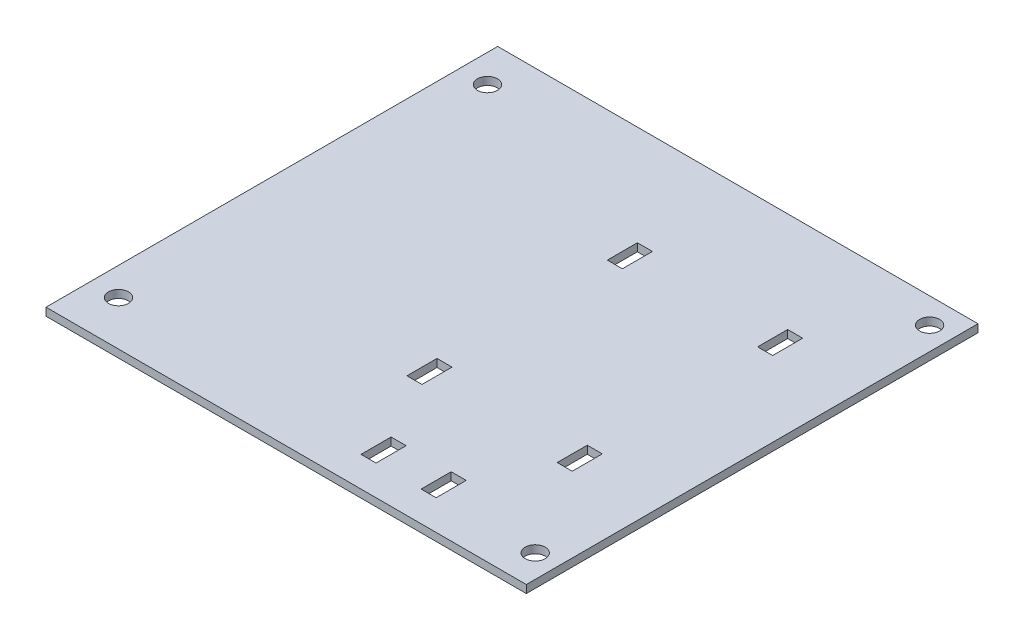
ISO-10303-21;
HEADER;
FILE_DESCRIPTION(('STEP AP214'),'2;1');
FILE_NAME('part.step','',(''),(''),'','','');
FILE_SCHEMA(('AUTOMOTIVE_DESIGN { 1 0 10303 214 1 1 1 1 }'));
ENDSEC;
DATA;
#1=APPLICATION_CONTEXT('core data for automotive mechanical design processes');
#2=APPLICATION_PROTOCOL_DEFINITION('international standard','automotive_design',2000,#1);
#3=PRODUCT_CONTEXT('',#1,'mechanical');
#4=PRODUCT('Part','Part','',(#3));
#5=PRODUCT_RELATED_PRODUCT_CATEGORY('part','',(#4));
#6=PRODUCT_DEFINITION_FORMATION('','',#4);
#7=PRODUCT_DEFINITION_CONTEXT('part definition',#1,'design');
#8=PRODUCT_DEFINITION('design','',#6,#7);
#9=PRODUCT_DEFINITION_SHAPE('','',#8);
#10=(LENGTH_UNIT() NAMED_UNIT(*) SI_UNIT(.MILLI.,.METRE.));
#11=(NAMED_UNIT(*) PLANE_ANGLE_UNIT() SI_UNIT($,.RADIAN.));
#12=(NAMED_UNIT(*) SI_UNIT($,.STERADIAN.) SOLID_ANGLE_UNIT());
#13=UNCERTAINTY_MEASURE_WITH_UNIT(LENGTH_MEASURE(1.E-05),#10,'distance_accuracy_value','');
#14=(GEOMETRIC_REPRESENTATION_CONTEXT(3) GLOBAL_UNCERTAINTY_ASSIGNED_CONTEXT((#13)) GLOBAL_UNIT_ASSIGNED_CONTEXT((#10,
#11,#12)) REPRESENTATION_CONTEXT('',''));
#15=CARTESIAN_POINT('',(0.,0.,0.));
#16=DIRECTION('',(0.,0.,1.));
#17=DIRECTION('',(1.,0.,0.));
#18=AXIS2_PLACEMENT_3D('',#15,#16,#17);
#19=CARTESIAN_POINT('',(-32.2440500490529,1.57,-18.5489965335949));
#20=DIRECTION('',(0.,0.,-1.));
#21=DIRECTION('',(-1.,0.,0.));
#22=AXIS2_PLACEMENT_3D('',#19,#20,#21);
#23=PLANE('',#22);
#24=DIRECTION('',(1.,0.,0.));
#25=VECTOR('',#24,1.);
#26=CARTESIAN_POINT('',(-32.2440500490529,0.,-18.5489965335949));
#27=LINE('',#26,#25);
#28=CARTESIAN_POINT('',(-31.7440500490529,0.,-18.5489965335949));
#29=VERTEX_POINT('',#28);
#30=CARTESIAN_POINT('',(64.1459499509471,0.,-18.5489965335949));
#31=VERTEX_POINT('',#30);
#32=EDGE_CURVE('E389',#29,#31,#27,.T.);
#33=ORIENTED_EDGE('',*,*,#32,.T.);
#34=DIRECTION('',(0.,1.,0.));
#35=VECTOR('',#34,1.);
#36=CARTESIAN_POINT('',(64.1459499509471,0.,-18.5489965335949));
#37=LINE('',#36,#35);
#38=CARTESIAN_POINT('',(64.1459499509471,1.57,-18.5489965335949));
#39=VERTEX_POINT('',#38);
#40=EDGE_CURVE('E352',#31,#39,#37,.T.);
#41=ORIENTED_EDGE('',*,*,#40,.T.);
#42=DIRECTION('',(1.,0.,0.));
#43=VECTOR('',#42,1.);
#44=CARTESIAN_POINT('',(-32.2440500490529,1.57,-18.5489965335949));
#45=LINE('',#44,#43);
#46=CARTESIAN_POINT('',(-31.7440500490529,1.57,-18.5489965335949));
#47=VERTEX_POINT('',#46);
#48=EDGE_CURVE('E392',#47,#39,#45,.T.);
#49=ORIENTED_EDGE('',*,*,#48,.F.);
#50=DIRECTION('',(0.,1.,0.));
#51=VECTOR('',#50,1.);
#52=CARTESIAN_POINT('',(-31.7440500490529,0.,-18.5489965335949));
#53=LINE('',#52,#51);
#54=EDGE_CURVE('E360',#29,#47,#53,.T.);
#55=ORIENTED_EDGE('',*,*,#54,.F.);
#56=EDGE_LOOP('',(#33,#41,#49,#55));
#57=FACE_BOUND('',#56,.T.);
#58=ADVANCED_FACE('F34',(#57),#23,.F.);
#59=CARTESIAN_POINT('',(-32.2440500490529,1.57,-108.718996533595));
#60=DIRECTION('',(0.,0.,1.));
#61=DIRECTION('',(1.,0.,0.));
#62=AXIS2_PLACEMENT_3D('',#59,#60,#61);
#63=PLANE('',#62);
#64=DIRECTION('',(-1.,0.,0.));
#65=VECTOR('',#64,1.);
#66=CARTESIAN_POINT('',(-32.2440500490529,1.57,-108.718996533595));
#67=LINE('',#66,#65);
#68=CARTESIAN_POINT('',(64.1459499509471,1.57,-108.718996533595));
#69=VERTEX_POINT('',#68);
#70=CARTESIAN_POINT('',(-31.7440500490529,1.57,-108.718996533595));
#71=VERTEX_POINT('',#70);
#72=EDGE_CURVE('E395',#69,#71,#67,.T.);
#73=ORIENTED_EDGE('',*,*,#72,.F.);
#74=DIRECTION('',(0.,1.,0.));
#75=VECTOR('',#74,1.);
#76=CARTESIAN_POINT('',(64.1459499509471,0.,-108.718996533595));
#77=LINE('',#76,#75);
#78=CARTESIAN_POINT('',(64.1459499509471,0.,-108.718996533595));
#79=VERTEX_POINT('',#78);
#80=EDGE_CURVE('E350',#79,#69,#77,.T.);
#81=ORIENTED_EDGE('',*,*,#80,.F.);
#82=DIRECTION('',(-1.,0.,0.));
#83=VECTOR('',#82,1.);
#84=CARTESIAN_POINT('',(-32.2440500490529,0.,-108.718996533595));
#85=LINE('',#84,#83);
#86=CARTESIAN_POINT('',(-31.7440500490529,0.,-108.718996533595));
#87=VERTEX_POINT('',#86);
#88=EDGE_CURVE('E396',#79,#87,#85,.T.);
#89=ORIENTED_EDGE('',*,*,#88,.T.);
#90=DIRECTION('',(0.,1.,0.));
#91=VECTOR('',#90,1.);
#92=CARTESIAN_POINT('',(-31.7440500490529,0.,-108.718996533595));
#93=LINE('',#92,#91);
#94=EDGE_CURVE('E363',#87,#71,#93,.T.);
#95=ORIENTED_EDGE('',*,*,#94,.T.);
#96=EDGE_LOOP('',(#73,#81,#89,#95));
#97=FACE_BOUND('',#96,.T.);
#98=ADVANCED_FACE('F485',(#97),#63,.F.);
#99=CARTESIAN_POINT('',(0.,1.57,0.));
#100=DIRECTION('',(0.,1.,0.));
#101=DIRECTION('',(0.,0.,1.));
#102=AXIS2_PLACEMENT_3D('',#99,#100,#101);
#103=PLANE('',#102);
#104=DIRECTION('',(0.,0.,1.));
#105=VECTOR('',#104,1.);
#106=CARTESIAN_POINT('',(37.1459499509471,1.57,-30.5489965335949));
#107=LINE('',#106,#105);
#108=CARTESIAN_POINT('',(37.1459499509471,1.57,-30.5489965335949));
#109=VERTEX_POINT('',#108);
#110=CARTESIAN_POINT('',(37.1459499509471,1.57,-24.5489965335949));
#111=VERTEX_POINT('',#110);
#112=EDGE_CURVE('E48',#109,#111,#107,.T.);
#113=ORIENTED_EDGE('',*,*,#112,.F.);
#114=DIRECTION('',(-1.,0.,0.));
#115=VECTOR('',#114,1.);
#116=CARTESIAN_POINT('',(37.1459499509471,1.57,-30.5489965335949));
#117=LINE('',#116,#115);
#118=CARTESIAN_POINT('',(40.1459499509471,1.57,-30.5489965335949));
#119=VERTEX_POINT('',#118);
#120=EDGE_CURVE('E237',#119,#109,#117,.T.);
#121=ORIENTED_EDGE('',*,*,#120,.F.);
#122=DIRECTION('',(0.,0.,-1.));
#123=VECTOR('',#122,1.);
#124=CARTESIAN_POINT('',(40.1459499509471,1.57,-30.5489965335949));
#125=LINE('',#124,#123);
#126=CARTESIAN_POINT('',(40.1459499509471,1.57,-24.5489965335949));
#127=VERTEX_POINT('',#126);
#128=EDGE_CURVE('E221',#127,#119,#125,.T.);
#129=ORIENTED_EDGE('',*,*,#128,.F.);
#130=DIRECTION('',(1.,0.,0.));
#131=VECTOR('',#130,1.);
#132=CARTESIAN_POINT('',(37.1459499509471,1.57,-24.5489965335949));
#133=LINE('',#132,#131);
#134=EDGE_CURVE('E230',#111,#127,#133,.T.);
#135=ORIENTED_EDGE('',*,*,#134,.F.);
#136=EDGE_LOOP('',(#113,#121,#129,#135));
#137=FACE_BOUND('',#136,.T.);
#138=DIRECTION('',(0.,0.,1.));
#139=VECTOR('',#138,1.);
#140=CARTESIAN_POINT('',(25.1459499509471,1.57,-30.5489965335949));
#141=LINE('',#140,#139);
#142=CARTESIAN_POINT('',(25.1459499509471,1.57,-30.5489965335949));
#143=VERTEX_POINT('',#142);
#144=CARTESIAN_POINT('',(25.1459499509471,1.57,-24.5489965335949));
#145=VERTEX_POINT('',#144);
#146=EDGE_CURVE('E244',#143,#145,#141,.T.);
#147=ORIENTED_EDGE('',*,*,#146,.F.);
#148=DIRECTION('',(-1.,0.,0.));
#149=VECTOR('',#148,1.);
#150=CARTESIAN_POINT('',(25.1459499509471,1.57,-30.5489965335949));
#151=LINE('',#150,#149);
#152=CARTESIAN_POINT('',(28.1459499509471,1.57,-30.5489965335949));
#153=VERTEX_POINT('',#152);
#154=EDGE_CURVE('E254',#153,#143,#151,.T.);
#155=ORIENTED_EDGE('',*,*,#154,.F.);
#156=DIRECTION('',(0.,0.,-1.));
#157=VECTOR('',#156,1.);
#158=CARTESIAN_POINT('',(28.1459499509471,1.57,-30.5489965335949));
#159=LINE('',#158,#157);
#160=CARTESIAN_POINT('',(28.1459499509471,1.57,-24.5489965335949));
#161=VERTEX_POINT('',#160);
#162=EDGE_CURVE('E251',#161,#153,#159,.T.);
#163=ORIENTED_EDGE('',*,*,#162,.F.);
#164=DIRECTION('',(1.,0.,0.));
#165=VECTOR('',#164,1.);
#166=CARTESIAN_POINT('',(25.1459499509471,1.57,-24.5489965335949));
#167=LINE('',#166,#165);
#168=EDGE_CURVE('E248',#145,#161,#167,.T.);
#169=ORIENTED_EDGE('',*,*,#168,.F.);
#170=EDGE_LOOP('',(#147,#155,#163,#169));
#171=FACE_BOUND('',#170,.T.);
#172=DIRECTION('',(0.,0.,1.));
#173=VECTOR('',#172,1.);
#174=CARTESIAN_POINT('',(46.1459499509471,1.57,-48.7189965335949));
#175=LINE('',#174,#173);
#176=CARTESIAN_POINT('',(46.1459499509471,1.57,-48.7189965335949));
#177=VERTEX_POINT('',#176);
#178=CARTESIAN_POINT('',(46.1459499509471,1.57,-42.7189965335949));
#179=VERTEX_POINT('',#178);
#180=EDGE_CURVE('E260',#177,#179,#175,.T.);
#181=ORIENTED_EDGE('',*,*,#180,.F.);
#182=DIRECTION('',(-1.,0.,0.));
#183=VECTOR('',#182,1.);
#184=CARTESIAN_POINT('',(46.1459499509471,1.57,-48.7189965335949));
#185=LINE('',#184,#183);
#186=CARTESIAN_POINT('',(49.1459499509471,1.57,-48.7189965335949));
#187=VERTEX_POINT('',#186);
#188=EDGE_CURVE('E274',#187,#177,#185,.T.);
#189=ORIENTED_EDGE('',*,*,#188,.F.);
#190=DIRECTION('',(0.,0.,-1.));
#191=VECTOR('',#190,1.);
#192=CARTESIAN_POINT('',(49.1459499509471,1.57,-48.7189965335949));
#193=LINE('',#192,#191);
#194=CARTESIAN_POINT('',(49.1459499509471,1.57,-42.7189965335949));
#195=VERTEX_POINT('',#194);
#196=EDGE_CURVE('E271',#195,#187,#193,.T.);
#197=ORIENTED_EDGE('',*,*,#196,.F.);
#198=DIRECTION('',(1.,0.,0.));
#199=VECTOR('',#198,1.);
#200=CARTESIAN_POINT('',(46.1459499509471,1.57,-42.7189965335949));
#201=LINE('',#200,#199);
#202=EDGE_CURVE('E268',#179,#195,#201,.T.);
#203=ORIENTED_EDGE('',*,*,#202,.F.);
#204=EDGE_LOOP('',(#181,#189,#197,#203));
#205=FACE_BOUND('',#204,.T.);
#206=DIRECTION('',(0.,0.,1.));
#207=VECTOR('',#206,1.);
#208=CARTESIAN_POINT('',(16.1459499509471,1.57,-48.7189965335949));
#209=LINE('',#208,#207);
#210=CARTESIAN_POINT('',(16.1459499509471,1.57,-48.7189965335949));
#211=VERTEX_POINT('',#210);
#212=CARTESIAN_POINT('',(16.1459499509471,1.57,-42.7189965335949));
#213=VERTEX_POINT('',#212);
#214=EDGE_CURVE('E280',#211,#213,#209,.T.);
#215=ORIENTED_EDGE('',*,*,#214,.F.);
#216=DIRECTION('',(-1.,0.,0.));
#217=VECTOR('',#216,1.);
#218=CARTESIAN_POINT('',(16.1459499509471,1.57,-48.7189965335949));
#219=LINE('',#218,#217);
#220=CARTESIAN_POINT('',(19.1459499509471,1.57,-48.7189965335949));
#221=VERTEX_POINT('',#220);
#222=EDGE_CURVE('E294',#221,#211,#219,.T.);
#223=ORIENTED_EDGE('',*,*,#222,.F.);
#224=DIRECTION('',(0.,0.,-1.));
#225=VECTOR('',#224,1.);
#226=CARTESIAN_POINT('',(19.1459499509471,1.57,-48.7189965335949));
#227=LINE('',#226,#225);
#228=CARTESIAN_POINT('',(19.1459499509471,1.57,-42.7189965335949));
#229=VERTEX_POINT('',#228);
#230=EDGE_CURVE('E291',#229,#221,#227,.T.);
#231=ORIENTED_EDGE('',*,*,#230,.F.);
#232=DIRECTION('',(1.,0.,0.));
#233=VECTOR('',#232,1.);
#234=CARTESIAN_POINT('',(16.1459499509471,1.57,-42.7189965335949));
#235=LINE('',#234,#233);
#236=EDGE_CURVE('E288',#213,#229,#235,.T.);
#237=ORIENTED_EDGE('',*,*,#236,.F.);
#238=EDGE_LOOP('',(#215,#223,#231,#237));
#239=FACE_BOUND('',#238,.T.);
#240=DIRECTION('',(0.,0.,1.));
#241=VECTOR('',#240,1.);
#242=CARTESIAN_POINT('',(46.1459499509471,1.57,-88.7189965335949));
#243=LINE('',#242,#241);
#244=CARTESIAN_POINT('',(46.1459499509471,1.57,-88.7189965335949));
#245=VERTEX_POINT('',#244);
#246=CARTESIAN_POINT('',(46.1459499509471,1.57,-82.7189965335949));
#247=VERTEX_POINT('',#246);
#248=EDGE_CURVE('E300',#245,#247,#243,.T.);
#249=ORIENTED_EDGE('',*,*,#248,.F.);
#250=DIRECTION('',(-1.,0.,0.));
#251=VECTOR('',#250,1.);
#252=CARTESIAN_POINT('',(46.1459499509471,1.57,-88.7189965335949));
#253=LINE('',#252,#251);
#254=CARTESIAN_POINT('',(49.1459499509471,1.57,-88.7189965335949));
#255=VERTEX_POINT('',#254);
#256=EDGE_CURVE('E314',#255,#245,#253,.T.);
#257=ORIENTED_EDGE('',*,*,#256,.F.);
#258=DIRECTION('',(0.,0.,-1.));
#259=VECTOR('',#258,1.);
#260=CARTESIAN_POINT('',(49.1459499509471,1.57,-88.7189965335949));
#261=LINE('',#260,#259);
#262=CARTESIAN_POINT('',(49.1459499509471,1.57,-82.7189965335949));
#263=VERTEX_POINT('',#262);
#264=EDGE_CURVE('E311',#263,#255,#261,.T.);
#265=ORIENTED_EDGE('',*,*,#264,.F.);
#266=DIRECTION('',(1.,0.,0.));
#267=VECTOR('',#266,1.);
#268=CARTESIAN_POINT('',(46.1459499509471,1.57,-82.7189965335949));
#269=LINE('',#268,#267);
#270=EDGE_CURVE('E308',#247,#263,#269,.T.);
#271=ORIENTED_EDGE('',*,*,#270,.F.);
#272=EDGE_LOOP('',(#249,#257,#265,#271));
#273=FACE_BOUND('',#272,.T.);
#274=DIRECTION('',(0.,0.,1.));
#275=VECTOR('',#274,1.);
#276=CARTESIAN_POINT('',(16.1459499509471,1.57,-88.7189965335949));
#277=LINE('',#276,#275);
#278=CARTESIAN_POINT('',(16.1459499509471,1.57,-88.7189965335949));
#279=VERTEX_POINT('',#278);
#280=CARTESIAN_POINT('',(16.1459499509471,1.57,-82.7189965335949));
#281=VERTEX_POINT('',#280);
#282=EDGE_CURVE('E320',#279,#281,#277,.T.);
#283=ORIENTED_EDGE('',*,*,#282,.F.);
#284=DIRECTION('',(-1.,0.,0.));
#285=VECTOR('',#284,1.);
#286=CARTESIAN_POINT('',(16.1459499509471,1.57,-88.7189965335949));
#287=LINE('',#286,#285);
#288=CARTESIAN_POINT('',(19.1459499509471,1.57,-88.7189965335949));
#289=VERTEX_POINT('',#288);
#290=EDGE_CURVE('E334',#289,#279,#287,.T.);
#291=ORIENTED_EDGE('',*,*,#290,.F.);
#292=DIRECTION('',(0.,0.,-1.));
#293=VECTOR('',#292,1.);
#294=CARTESIAN_POINT('',(19.1459499509471,1.57,-88.7189965335949));
#295=LINE('',#294,#293);
#296=CARTESIAN_POINT('',(19.1459499509471,1.57,-82.7189965335949));
#297=VERTEX_POINT('',#296);
#298=EDGE_CURVE('E331',#297,#289,#295,.T.);
#299=ORIENTED_EDGE('',*,*,#298,.F.);
#300=DIRECTION('',(1.,0.,0.));
#301=VECTOR('',#300,1.);
#302=CARTESIAN_POINT('',(16.1459499509471,1.57,-82.7189965335949));
#303=LINE('',#302,#301);
#304=EDGE_CURVE('E328',#281,#297,#303,.T.);
#305=ORIENTED_EDGE('',*,*,#304,.F.);
#306=EDGE_LOOP('',(#283,#291,#299,#305));
#307=FACE_BOUND('',#306,.T.);
#308=DIRECTION('',(0.,0.,1.));
#309=VECTOR('',#308,1.);
#310=CARTESIAN_POINT('',(64.1459499509471,1.57,-108.718996533595));
#311=LINE('',#310,#309);
#312=EDGE_CURVE('E340',#69,#39,#311,.T.);
#313=ORIENTED_EDGE('',*,*,#312,.F.);
#314=ORIENTED_EDGE('',*,*,#72,.T.);
#315=DIRECTION('',(0.,0.,-1.));
#316=VECTOR('',#315,1.);
#317=CARTESIAN_POINT('',(-31.7440500490529,1.57,-18.5489965335949));
#318=LINE('',#317,#316);
#319=EDGE_CURVE('E355',#47,#71,#318,.T.);
#320=ORIENTED_EDGE('',*,*,#319,.F.);
#321=ORIENTED_EDGE('',*,*,#48,.T.);
#322=EDGE_LOOP('',(#313,#314,#320,#321));
#323=FACE_BOUND('',#322,.T.);
#324=CARTESIAN_POINT('',(59.5659499509471,1.57,-103.638996533595));
#325=DIRECTION('',(0.,1.,0.));
#326=DIRECTION('',(0.,0.,1.));
#327=AXIS2_PLACEMENT_3D('',#324,#325,#326);
#328=CIRCLE('',#327,2.);
#329=CARTESIAN_POINT('',(59.5659499509471,1.57,-101.638996533595));
#330=VERTEX_POINT('',#329);
#331=EDGE_CURVE('E366',#330,#330,#328,.T.);
#332=ORIENTED_EDGE('',*,*,#331,.F.);
#333=EDGE_LOOP('',(#332));
#334=FACE_BOUND('',#333,.T.);
#335=CARTESIAN_POINT('',(-26.1640500490529,1.57,-101.098996533595));
#336=DIRECTION('',(0.,1.,0.));
#337=DIRECTION('',(0.,0.,1.));
#338=AXIS2_PLACEMENT_3D('',#335,#336,#337);
#339=CIRCLE('',#338,2.);
#340=CARTESIAN_POINT('',(-26.1640500490529,1.57,-99.0989965335949));
#341=VERTEX_POINT('',#340);
#342=EDGE_CURVE('E371',#341,#341,#339,.T.);
#343=ORIENTED_EDGE('',*,*,#342,.F.);
#344=EDGE_LOOP('',(#343));
#345=FACE_BOUND('',#344,.T.);
#346=CARTESIAN_POINT('',(-26.1640500490529,1.57,-27.4389965335949));
#347=DIRECTION('',(0.,1.,0.));
#348=DIRECTION('',(0.,0.,1.));
#349=AXIS2_PLACEMENT_3D('',#346,#347,#348);
#350=CIRCLE('',#349,2.);
#351=CARTESIAN_POINT('',(-26.1640500490529,1.57,-25.4389965335949));
#352=VERTEX_POINT('',#351);
#353=EDGE_CURVE('E377',#352,#352,#350,.T.);
#354=ORIENTED_EDGE('',*,*,#353,.F.);
#355=EDGE_LOOP('',(#354));
#356=FACE_BOUND('',#355,.T.);
#357=CARTESIAN_POINT('',(59.5659499509471,1.57,-24.8989965335949));
#358=DIRECTION('',(0.,1.,0.));
#359=DIRECTION('',(0.,0.,1.));
#360=AXIS2_PLACEMENT_3D('',#357,#358,#359);
#361=CIRCLE('',#360,2.);
#362=CARTESIAN_POINT('',(59.5659499509471,1.57,-22.8989965335949));
#363=VERTEX_POINT('',#362);
#364=EDGE_CURVE('E383',#363,#363,#361,.T.);
#365=ORIENTED_EDGE('',*,*,#364,.F.);
#366=EDGE_LOOP('',(#365));
#367=FACE_BOUND('',#366,.T.);
#368=ADVANCED_FACE('F234',(#137,#171,#205,#239,#273,#307,#323,#334,#345,#356,#367),#103,.T.);
#369=CARTESIAN_POINT('',(0.,0.,0.));
#370=DIRECTION('',(0.,1.,0.));
#371=DIRECTION('',(0.,0.,1.));
#372=AXIS2_PLACEMENT_3D('',#369,#370,#371);
#373=PLANE('',#372);
#374=DIRECTION('',(-1.,0.,0.));
#375=VECTOR('',#374,1.);
#376=CARTESIAN_POINT('',(0.,0.,-30.5489965335949));
#377=LINE('',#376,#375);
#378=CARTESIAN_POINT('',(40.1459499509471,0.,-30.5489965335949));
#379=VERTEX_POINT('',#378);
#380=CARTESIAN_POINT('',(37.1459499509471,0.,-30.5489965335949));
#381=VERTEX_POINT('',#380);
#382=EDGE_CURVE('E41',#379,#381,#377,.T.);
#383=ORIENTED_EDGE('',*,*,#382,.T.);
#384=DIRECTION('',(0.,0.,1.));
#385=VECTOR('',#384,1.);
#386=CARTESIAN_POINT('',(37.1459499509471,0.,0.));
#387=LINE('',#386,#385);
#388=CARTESIAN_POINT('',(37.1459499509471,0.,-24.5489965335949));
#389=VERTEX_POINT('',#388);
#390=EDGE_CURVE('E11',#381,#389,#387,.T.);
#391=ORIENTED_EDGE('',*,*,#390,.T.);
#392=DIRECTION('',(1.,0.,0.));
#393=VECTOR('',#392,1.);
#394=CARTESIAN_POINT('',(0.,0.,-24.5489965335949));
#395=LINE('',#394,#393);
#396=CARTESIAN_POINT('',(40.1459499509471,0.,-24.5489965335949));
#397=VERTEX_POINT('',#396);
#398=EDGE_CURVE('E461',#389,#397,#395,.T.);
#399=ORIENTED_EDGE('',*,*,#398,.T.);
#400=DIRECTION('',(0.,0.,-1.));
#401=VECTOR('',#400,1.);
#402=CARTESIAN_POINT('',(40.1459499509471,0.,0.));
#403=LINE('',#402,#401);
#404=EDGE_CURVE('E224',#397,#379,#403,.T.);
#405=ORIENTED_EDGE('',*,*,#404,.T.);
#406=EDGE_LOOP('',(#383,#391,#399,#405));
#407=FACE_BOUND('',#406,.T.);
#408=DIRECTION('',(-1.,0.,0.));
#409=VECTOR('',#408,1.);
#410=CARTESIAN_POINT('',(0.,0.,-30.5489965335949));
#411=LINE('',#410,#409);
#412=CARTESIAN_POINT('',(28.1459499509471,0.,-30.5489965335949));
#413=VERTEX_POINT('',#412);
#414=CARTESIAN_POINT('',(25.1459499509471,0.,-30.5489965335949));
#415=VERTEX_POINT('',#414);
#416=EDGE_CURVE('E455',#413,#415,#411,.T.);
#417=ORIENTED_EDGE('',*,*,#416,.T.);
#418=DIRECTION('',(0.,0.,1.));
#419=VECTOR('',#418,1.);
#420=CARTESIAN_POINT('',(25.1459499509471,0.,0.));
#421=LINE('',#420,#419);
#422=CARTESIAN_POINT('',(25.1459499509471,0.,-24.5489965335949));
#423=VERTEX_POINT('',#422);
#424=EDGE_CURVE('E458',#415,#423,#421,.T.);
#425=ORIENTED_EDGE('',*,*,#424,.T.);
#426=DIRECTION('',(1.,0.,0.));
#427=VECTOR('',#426,1.);
#428=CARTESIAN_POINT('',(0.,0.,-24.5489965335949));
#429=LINE('',#428,#427);
#430=CARTESIAN_POINT('',(28.1459499509471,0.,-24.5489965335949));
#431=VERTEX_POINT('',#430);
#432=EDGE_CURVE('E449',#423,#431,#429,.T.);
#433=ORIENTED_EDGE('',*,*,#432,.T.);
#434=DIRECTION('',(0.,0.,-1.));
#435=VECTOR('',#434,1.);
#436=CARTESIAN_POINT('',(28.1459499509471,0.,0.));
#437=LINE('',#436,#435);
#438=EDGE_CURVE('E452',#431,#413,#437,.T.);
#439=ORIENTED_EDGE('',*,*,#438,.T.);
#440=EDGE_LOOP('',(#417,#425,#433,#439));
#441=FACE_BOUND('',#440,.T.);
#442=DIRECTION('',(-1.,0.,0.));
#443=VECTOR('',#442,1.);
#444=CARTESIAN_POINT('',(0.,0.,-48.7189965335949));
#445=LINE('',#444,#443);
#446=CARTESIAN_POINT('',(49.1459499509471,0.,-48.7189965335949));
#447=VERTEX_POINT('',#446);
#448=CARTESIAN_POINT('',(46.1459499509471,0.,-48.7189965335949));
#449=VERTEX_POINT('',#448);
#450=EDGE_CURVE('E443',#447,#449,#445,.T.);
#451=ORIENTED_EDGE('',*,*,#450,.T.);
#452=DIRECTION('',(0.,0.,1.));
#453=VECTOR('',#452,1.);
#454=CARTESIAN_POINT('',(46.1459499509471,0.,0.));
#455=LINE('',#454,#453);
#456=CARTESIAN_POINT('',(46.1459499509471,0.,-42.7189965335949));
#457=VERTEX_POINT('',#456);
#458=EDGE_CURVE('E446',#449,#457,#455,.T.);
#459=ORIENTED_EDGE('',*,*,#458,.T.);
#460=DIRECTION('',(1.,0.,0.));
#461=VECTOR('',#460,1.);
#462=CARTESIAN_POINT('',(0.,0.,-42.7189965335949));
#463=LINE('',#462,#461);
#464=CARTESIAN_POINT('',(49.1459499509471,0.,-42.7189965335949));
#465=VERTEX_POINT('',#464);
#466=EDGE_CURVE('E437',#457,#465,#463,.T.);
#467=ORIENTED_EDGE('',*,*,#466,.T.);
#468=DIRECTION('',(0.,0.,-1.));
#469=VECTOR('',#468,1.);
#470=CARTESIAN_POINT('',(49.1459499509471,0.,0.));
#471=LINE('',#470,#469);
#472=EDGE_CURVE('E440',#465,#447,#471,.T.);
#473=ORIENTED_EDGE('',*,*,#472,.T.);
#474=EDGE_LOOP('',(#451,#459,#467,#473));
#475=FACE_BOUND('',#474,.T.);
#476=DIRECTION('',(-1.,0.,0.));
#477=VECTOR('',#476,1.);
#478=CARTESIAN_POINT('',(0.,0.,-48.7189965335949));
#479=LINE('',#478,#477);
#480=CARTESIAN_POINT('',(19.1459499509471,0.,-48.7189965335949));
#481=VERTEX_POINT('',#480);
#482=CARTESIAN_POINT('',(16.1459499509471,0.,-48.7189965335949));
#483=VERTEX_POINT('',#482);
#484=EDGE_CURVE('E431',#481,#483,#479,.T.);
#485=ORIENTED_EDGE('',*,*,#484,.T.);
#486=DIRECTION('',(0.,0.,1.));
#487=VECTOR('',#486,1.);
#488=CARTESIAN_POINT('',(16.1459499509471,0.,0.));
#489=LINE('',#488,#487);
#490=CARTESIAN_POINT('',(16.1459499509471,0.,-42.7189965335949));
#491=VERTEX_POINT('',#490);
#492=EDGE_CURVE('E434',#483,#491,#489,.T.);
#493=ORIENTED_EDGE('',*,*,#492,.T.);
#494=DIRECTION('',(1.,0.,0.));
#495=VECTOR('',#494,1.);
#496=CARTESIAN_POINT('',(0.,0.,-42.7189965335949));
#497=LINE('',#496,#495);
#498=CARTESIAN_POINT('',(19.1459499509471,0.,-42.7189965335949));
#499=VERTEX_POINT('',#498);
#500=EDGE_CURVE('E425',#491,#499,#497,.T.);
#501=ORIENTED_EDGE('',*,*,#500,.T.);
#502=DIRECTION('',(0.,0.,-1.));
#503=VECTOR('',#502,1.);
#504=CARTESIAN_POINT('',(19.1459499509471,0.,0.));
#505=LINE('',#504,#503);
#506=EDGE_CURVE('E428',#499,#481,#505,.T.);
#507=ORIENTED_EDGE('',*,*,#506,.T.);
#508=EDGE_LOOP('',(#485,#493,#501,#507));
#509=FACE_BOUND('',#508,.T.);
#510=DIRECTION('',(-1.,0.,0.));
#511=VECTOR('',#510,1.);
#512=CARTESIAN_POINT('',(0.,0.,-88.7189965335949));
#513=LINE('',#512,#511);
#514=CARTESIAN_POINT('',(49.1459499509471,0.,-88.7189965335949));
#515=VERTEX_POINT('',#514);
#516=CARTESIAN_POINT('',(46.1459499509471,0.,-88.7189965335949));
#517=VERTEX_POINT('',#516);
#518=EDGE_CURVE('E419',#515,#517,#513,.T.);
#519=ORIENTED_EDGE('',*,*,#518,.T.);
#520=DIRECTION('',(0.,0.,1.));
#521=VECTOR('',#520,1.);
#522=CARTESIAN_POINT('',(46.1459499509471,0.,0.));
#523=LINE('',#522,#521);
#524=CARTESIAN_POINT('',(46.1459499509471,0.,-82.7189965335949));
#525=VERTEX_POINT('',#524);
#526=EDGE_CURVE('E422',#517,#525,#523,.T.);
#527=ORIENTED_EDGE('',*,*,#526,.T.);
#528=DIRECTION('',(1.,0.,0.));
#529=VECTOR('',#528,1.);
#530=CARTESIAN_POINT('',(0.,0.,-82.7189965335949));
#531=LINE('',#530,#529);
#532=CARTESIAN_POINT('',(49.1459499509471,0.,-82.7189965335949));
#533=VERTEX_POINT('',#532);
#534=EDGE_CURVE('E413',#525,#533,#531,.T.);
#535=ORIENTED_EDGE('',*,*,#534,.T.);
#536=DIRECTION('',(0.,0.,-1.));
#537=VECTOR('',#536,1.);
#538=CARTESIAN_POINT('',(49.1459499509471,0.,0.));
#539=LINE('',#538,#537);
#540=EDGE_CURVE('E416',#533,#515,#539,.T.);
#541=ORIENTED_EDGE('',*,*,#540,.T.);
#542=EDGE_LOOP('',(#519,#527,#535,#541));
#543=FACE_BOUND('',#542,.T.);
#544=DIRECTION('',(-1.,0.,0.));
#545=VECTOR('',#544,1.);
#546=CARTESIAN_POINT('',(0.,0.,-88.7189965335949));
#547=LINE('',#546,#545);
#548=CARTESIAN_POINT('',(19.1459499509471,0.,-88.7189965335949));
#549=VERTEX_POINT('',#548);
#550=CARTESIAN_POINT('',(16.1459499509471,0.,-88.7189965335949));
#551=VERTEX_POINT('',#550);
#552=EDGE_CURVE('E407',#549,#551,#547,.T.);
#553=ORIENTED_EDGE('',*,*,#552,.T.);
#554=DIRECTION('',(0.,0.,1.));
#555=VECTOR('',#554,1.);
#556=CARTESIAN_POINT('',(16.1459499509471,0.,0.));
#557=LINE('',#556,#555);
#558=CARTESIAN_POINT('',(16.1459499509471,0.,-82.7189965335949));
#559=VERTEX_POINT('',#558);
#560=EDGE_CURVE('E410',#551,#559,#557,.T.);
#561=ORIENTED_EDGE('',*,*,#560,.T.);
#562=DIRECTION('',(1.,0.,0.));
#563=VECTOR('',#562,1.);
#564=CARTESIAN_POINT('',(0.,0.,-82.7189965335949));
#565=LINE('',#564,#563);
#566=CARTESIAN_POINT('',(19.1459499509471,0.,-82.7189965335949));
#567=VERTEX_POINT('',#566);
#568=EDGE_CURVE('E398',#559,#567,#565,.T.);
#569=ORIENTED_EDGE('',*,*,#568,.T.);
#570=DIRECTION('',(0.,0.,-1.));
#571=VECTOR('',#570,1.);
#572=CARTESIAN_POINT('',(19.1459499509471,0.,0.));
#573=LINE('',#572,#571);
#574=EDGE_CURVE('E404',#567,#549,#573,.T.);
#575=ORIENTED_EDGE('',*,*,#574,.T.);
#576=EDGE_LOOP('',(#553,#561,#569,#575));
#577=FACE_BOUND('',#576,.T.);
#578=CARTESIAN_POINT('',(59.5659499509471,0.,-103.638996533595));
#579=DIRECTION('',(0.,1.,0.));
#580=DIRECTION('',(0.,0.,1.));
#581=AXIS2_PLACEMENT_3D('',#578,#579,#580);
#582=CIRCLE('',#581,2.);
#583=CARTESIAN_POINT('',(59.5659499509471,0.,-101.638996533595));
#584=VERTEX_POINT('',#583);
#585=EDGE_CURVE('E368',#584,#584,#582,.T.);
#586=ORIENTED_EDGE('',*,*,#585,.T.);
#587=EDGE_LOOP('',(#586));
#588=FACE_BOUND('',#587,.T.);
#589=CARTESIAN_POINT('',(-26.1640500490529,0.,-101.098996533595));
#590=DIRECTION('',(0.,1.,0.));
#591=DIRECTION('',(0.,0.,1.));
#592=AXIS2_PLACEMENT_3D('',#589,#590,#591);
#593=CIRCLE('',#592,2.);
#594=CARTESIAN_POINT('',(-26.1640500490529,0.,-99.0989965335949));
#595=VERTEX_POINT('',#594);
#596=EDGE_CURVE('E374',#595,#595,#593,.T.);
#597=ORIENTED_EDGE('',*,*,#596,.T.);
#598=EDGE_LOOP('',(#597));
#599=FACE_BOUND('',#598,.T.);
#600=CARTESIAN_POINT('',(-26.1640500490529,0.,-27.4389965335949));
#601=DIRECTION('',(0.,1.,0.));
#602=DIRECTION('',(0.,0.,1.));
#603=AXIS2_PLACEMENT_3D('',#600,#601,#602);
#604=CIRCLE('',#603,2.);
#605=CARTESIAN_POINT('',(-26.1640500490529,0.,-25.4389965335949));
#606=VERTEX_POINT('',#605);
#607=EDGE_CURVE('E380',#606,#606,#604,.T.);
#608=ORIENTED_EDGE('',*,*,#607,.T.);
#609=EDGE_LOOP('',(#608));
#610=FACE_BOUND('',#609,.T.);
#611=CARTESIAN_POINT('',(59.5659499509471,0.,-24.8989965335949));
#612=DIRECTION('',(0.,1.,0.));
#613=DIRECTION('',(0.,0.,1.));
#614=AXIS2_PLACEMENT_3D('',#611,#612,#613);
#615=CIRCLE('',#614,2.);
#616=CARTESIAN_POINT('',(59.5659499509471,0.,-22.8989965335949));
#617=VERTEX_POINT('',#616);
#618=EDGE_CURVE('E386',#617,#617,#615,.T.);
#619=ORIENTED_EDGE('',*,*,#618,.T.);
#620=EDGE_LOOP('',(#619));
#621=FACE_BOUND('',#620,.T.);
#622=ORIENTED_EDGE('',*,*,#88,.F.);
#623=DIRECTION('',(0.,0.,1.));
#624=VECTOR('',#623,1.);
#625=CARTESIAN_POINT('',(64.1459499509471,0.,-108.718996533595));
#626=LINE('',#625,#624);
#627=EDGE_CURVE('E347',#79,#31,#626,.T.);
#628=ORIENTED_EDGE('',*,*,#627,.T.);
#629=ORIENTED_EDGE('',*,*,#32,.F.);
#630=DIRECTION('',(0.,0.,-1.));
#631=VECTOR('',#630,1.);
#632=CARTESIAN_POINT('',(-31.7440500490529,0.,-18.5489965335949));
#633=LINE('',#632,#631);
#634=EDGE_CURVE('E357',#29,#87,#633,.T.);
#635=ORIENTED_EDGE('',*,*,#634,.T.);
#636=EDGE_LOOP('',(#622,#628,#629,#635));
#637=FACE_BOUND('',#636,.T.);
#638=ADVANCED_FACE('F465',(#407,#441,#475,#509,#543,#577,#588,#599,#610,#621,#637),#373,.F.);
#639=CARTESIAN_POINT('',(59.5659499509471,0.,-24.8989965335949));
#640=DIRECTION('',(0.,1.,0.));
#641=DIRECTION('',(0.,0.,1.));
#642=AXIS2_PLACEMENT_3D('',#639,#640,#641);
#643=CYLINDRICAL_SURFACE('',#642,2.);
#644=ORIENTED_EDGE('',*,*,#618,.F.);
#645=EDGE_LOOP('',(#644));
#646=FACE_BOUND('',#645,.T.);
#647=ORIENTED_EDGE('',*,*,#364,.T.);
#648=EDGE_LOOP('',(#647));
#649=FACE_BOUND('',#648,.T.);
#650=ADVANCED_FACE('F527',(#646,#649),#643,.F.);
#651=CARTESIAN_POINT('',(-26.1640500490529,0.,-27.4389965335949));
#652=DIRECTION('',(0.,1.,0.));
#653=DIRECTION('',(0.,0.,1.));
#654=AXIS2_PLACEMENT_3D('',#651,#652,#653);
#655=CYLINDRICAL_SURFACE('',#654,2.);
#656=ORIENTED_EDGE('',*,*,#607,.F.);
#657=EDGE_LOOP('',(#656));
#658=FACE_BOUND('',#657,.T.);
#659=ORIENTED_EDGE('',*,*,#353,.T.);
#660=EDGE_LOOP('',(#659));
#661=FACE_BOUND('',#660,.T.);
#662=ADVANCED_FACE('F523',(#658,#661),#655,.F.);
#663=CARTESIAN_POINT('',(-26.1640500490529,0.,-101.098996533595));
#664=DIRECTION('',(0.,1.,0.));
#665=DIRECTION('',(0.,0.,1.));
#666=AXIS2_PLACEMENT_3D('',#663,#664,#665);
#667=CYLINDRICAL_SURFACE('',#666,2.);
#668=ORIENTED_EDGE('',*,*,#596,.F.);
#669=EDGE_LOOP('',(#668));
#670=FACE_BOUND('',#669,.T.);
#671=ORIENTED_EDGE('',*,*,#342,.T.);
#672=EDGE_LOOP('',(#671));
#673=FACE_BOUND('',#672,.T.);
#674=ADVANCED_FACE('F516',(#670,#673),#667,.F.);
#675=CARTESIAN_POINT('',(59.5659499509471,0.,-103.638996533595));
#676=DIRECTION('',(0.,1.,0.));
#677=DIRECTION('',(0.,0.,1.));
#678=AXIS2_PLACEMENT_3D('',#675,#676,#677);
#679=CYLINDRICAL_SURFACE('',#678,2.);
#680=ORIENTED_EDGE('',*,*,#585,.F.);
#681=EDGE_LOOP('',(#680));
#682=FACE_BOUND('',#681,.T.);
#683=ORIENTED_EDGE('',*,*,#331,.T.);
#684=EDGE_LOOP('',(#683));
#685=FACE_BOUND('',#684,.T.);
#686=ADVANCED_FACE('F508',(#682,#685),#679,.F.);
#687=CARTESIAN_POINT('',(-31.7440500490529,0.,-18.5489965335949));
#688=DIRECTION('',(1.,0.,0.));
#689=DIRECTION('',(0.,0.,-1.));
#690=AXIS2_PLACEMENT_3D('',#687,#688,#689);
#691=PLANE('',#690);
#692=ORIENTED_EDGE('',*,*,#319,.T.);
#693=ORIENTED_EDGE('',*,*,#94,.F.);
#694=ORIENTED_EDGE('',*,*,#634,.F.);
#695=ORIENTED_EDGE('',*,*,#54,.T.);
#696=EDGE_LOOP('',(#692,#693,#694,#695));
#697=FACE_BOUND('',#696,.T.);
#698=ADVANCED_FACE('F506',(#697),#691,.F.);
#699=CARTESIAN_POINT('',(64.1459499509471,0.,-108.718996533595));
#700=DIRECTION('',(-1.,0.,0.));
#701=DIRECTION('',(0.,0.,1.));
#702=AXIS2_PLACEMENT_3D('',#699,#700,#701);
#703=PLANE('',#702);
#704=ORIENTED_EDGE('',*,*,#312,.T.);
#705=ORIENTED_EDGE('',*,*,#40,.F.);
#706=ORIENTED_EDGE('',*,*,#627,.F.);
#707=ORIENTED_EDGE('',*,*,#80,.T.);
#708=EDGE_LOOP('',(#704,#705,#706,#707));
#709=FACE_BOUND('',#708,.T.);
#710=ADVANCED_FACE('F498',(#709),#703,.F.);
#711=CARTESIAN_POINT('',(16.1459499509471,-8.43,-88.7189965335949));
#712=DIRECTION('',(-1.,0.,0.));
#713=DIRECTION('',(0.,0.,1.));
#714=AXIS2_PLACEMENT_3D('',#711,#712,#713);
#715=PLANE('',#714);
#716=DIRECTION('',(0.,1.,0.));
#717=VECTOR('',#716,1.);
#718=CARTESIAN_POINT('',(16.1459499509471,-8.43,-88.7189965335949));
#719=LINE('',#718,#717);
#720=EDGE_CURVE('E338',#551,#279,#719,.T.);
#721=ORIENTED_EDGE('',*,*,#720,.T.);
#722=ORIENTED_EDGE('',*,*,#282,.T.);
#723=DIRECTION('',(0.,1.,0.));
#724=VECTOR('',#723,1.);
#725=CARTESIAN_POINT('',(16.1459499509471,-8.43,-82.7189965335949));
#726=LINE('',#725,#724);
#727=EDGE_CURVE('E337',#559,#281,#726,.T.);
#728=ORIENTED_EDGE('',*,*,#727,.F.);
#729=ORIENTED_EDGE('',*,*,#560,.F.);
#730=EDGE_LOOP('',(#721,#722,#728,#729));
#731=FACE_BOUND('',#730,.T.);
#732=ADVANCED_FACE('F514',(#731),#715,.F.);
#733=CARTESIAN_POINT('',(16.1459499509471,-8.43,-88.7189965335949));
#734=DIRECTION('',(0.,0.,-1.));
#735=DIRECTION('',(-1.,0.,0.));
#736=AXIS2_PLACEMENT_3D('',#733,#734,#735);
#737=PLANE('',#736);
#738=DIRECTION('',(0.,1.,0.));
#739=VECTOR('',#738,1.);
#740=CARTESIAN_POINT('',(19.1459499509471,-8.43,-88.7189965335949));
#741=LINE('',#740,#739);
#742=EDGE_CURVE('E341',#549,#289,#741,.T.);
#743=ORIENTED_EDGE('',*,*,#742,.T.);
#744=ORIENTED_EDGE('',*,*,#290,.T.);
#745=ORIENTED_EDGE('',*,*,#720,.F.);
#746=ORIENTED_EDGE('',*,*,#552,.F.);
#747=EDGE_LOOP('',(#743,#744,#745,#746));
#748=FACE_BOUND('',#747,.T.);
#749=ADVANCED_FACE('F596',(#748),#737,.F.);
#750=CARTESIAN_POINT('',(19.1459499509471,-8.43,-88.7189965335949));
#751=DIRECTION('',(1.,0.,0.));
#752=DIRECTION('',(0.,0.,-1.));
#753=AXIS2_PLACEMENT_3D('',#750,#751,#752);
#754=PLANE('',#753);
#755=DIRECTION('',(0.,1.,0.));
#756=VECTOR('',#755,1.);
#757=CARTESIAN_POINT('',(19.1459499509471,-8.43,-82.7189965335949));
#758=LINE('',#757,#756);
#759=EDGE_CURVE('E343',#567,#297,#758,.T.);
#760=ORIENTED_EDGE('',*,*,#759,.T.);
#761=ORIENTED_EDGE('',*,*,#298,.T.);
#762=ORIENTED_EDGE('',*,*,#742,.F.);
#763=ORIENTED_EDGE('',*,*,#574,.F.);
#764=EDGE_LOOP('',(#760,#761,#762,#763));
#765=FACE_BOUND('',#764,.T.);
#766=ADVANCED_FACE('F602',(#765),#754,.F.);
#767=CARTESIAN_POINT('',(16.1459499509471,-8.43,-82.7189965335949));
#768=DIRECTION('',(0.,0.,1.));
#769=DIRECTION('',(1.,0.,0.));
#770=AXIS2_PLACEMENT_3D('',#767,#768,#769);
#771=PLANE('',#770);
#772=ORIENTED_EDGE('',*,*,#727,.T.);
#773=ORIENTED_EDGE('',*,*,#304,.T.);
#774=ORIENTED_EDGE('',*,*,#759,.F.);
#775=ORIENTED_EDGE('',*,*,#568,.F.);
#776=EDGE_LOOP('',(#772,#773,#774,#775));
#777=FACE_BOUND('',#776,.T.);
#778=ADVANCED_FACE('F610',(#777),#771,.F.);
#779=CARTESIAN_POINT('',(46.1459499509471,-8.43,-88.7189965335949));
#780=DIRECTION('',(-1.,0.,0.));
#781=DIRECTION('',(0.,0.,1.));
#782=AXIS2_PLACEMENT_3D('',#779,#780,#781);
#783=PLANE('',#782);
#784=DIRECTION('',(0.,1.,0.));
#785=VECTOR('',#784,1.);
#786=CARTESIAN_POINT('',(46.1459499509471,-8.43,-88.7189965335949));
#787=LINE('',#786,#785);
#788=EDGE_CURVE('E318',#517,#245,#787,.T.);
#789=ORIENTED_EDGE('',*,*,#788,.T.);
#790=ORIENTED_EDGE('',*,*,#248,.T.);
#791=DIRECTION('',(0.,1.,0.));
#792=VECTOR('',#791,1.);
#793=CARTESIAN_POINT('',(46.1459499509471,-8.43,-82.7189965335949));
#794=LINE('',#793,#792);
#795=EDGE_CURVE('E317',#525,#247,#794,.T.);
#796=ORIENTED_EDGE('',*,*,#795,.F.);
#797=ORIENTED_EDGE('',*,*,#526,.F.);
#798=EDGE_LOOP('',(#789,#790,#796,#797));
#799=FACE_BOUND('',#798,.T.);
#800=ADVANCED_FACE('F618',(#799),#783,.F.);
#801=CARTESIAN_POINT('',(46.1459499509471,-8.43,-88.7189965335949));
#802=DIRECTION('',(0.,0.,-1.));
#803=DIRECTION('',(-1.,0.,0.));
#804=AXIS2_PLACEMENT_3D('',#801,#802,#803);
#805=PLANE('',#804);
#806=DIRECTION('',(0.,1.,0.));
#807=VECTOR('',#806,1.);
#808=CARTESIAN_POINT('',(49.1459499509471,-8.43,-88.7189965335949));
#809=LINE('',#808,#807);
#810=EDGE_CURVE('E321',#515,#255,#809,.T.);
#811=ORIENTED_EDGE('',*,*,#810,.T.);
#812=ORIENTED_EDGE('',*,*,#256,.T.);
#813=ORIENTED_EDGE('',*,*,#788,.F.);
#814=ORIENTED_EDGE('',*,*,#518,.F.);
#815=EDGE_LOOP('',(#811,#812,#813,#814));
#816=FACE_BOUND('',#815,.T.);
#817=ADVANCED_FACE('F626',(#816),#805,.F.);
#818=CARTESIAN_POINT('',(49.1459499509471,-8.43,-88.7189965335949));
#819=DIRECTION('',(1.,0.,0.));
#820=DIRECTION('',(0.,0.,-1.));
#821=AXIS2_PLACEMENT_3D('',#818,#819,#820);
#822=PLANE('',#821);
#823=DIRECTION('',(0.,1.,0.));
#824=VECTOR('',#823,1.);
#825=CARTESIAN_POINT('',(49.1459499509471,-8.43,-82.7189965335949));
#826=LINE('',#825,#824);
#827=EDGE_CURVE('E323',#533,#263,#826,.T.);
#828=ORIENTED_EDGE('',*,*,#827,.T.);
#829=ORIENTED_EDGE('',*,*,#264,.T.);
#830=ORIENTED_EDGE('',*,*,#810,.F.);
#831=ORIENTED_EDGE('',*,*,#540,.F.);
#832=EDGE_LOOP('',(#828,#829,#830,#831));
#833=FACE_BOUND('',#832,.T.);
#834=ADVANCED_FACE('F634',(#833),#822,.F.);
#835=CARTESIAN_POINT('',(46.1459499509471,-8.43,-82.7189965335949));
#836=DIRECTION('',(0.,0.,1.));
#837=DIRECTION('',(1.,0.,0.));
#838=AXIS2_PLACEMENT_3D('',#835,#836,#837);
#839=PLANE('',#838);
#840=ORIENTED_EDGE('',*,*,#795,.T.);
#841=ORIENTED_EDGE('',*,*,#270,.T.);
#842=ORIENTED_EDGE('',*,*,#827,.F.);
#843=ORIENTED_EDGE('',*,*,#534,.F.);
#844=EDGE_LOOP('',(#840,#841,#842,#843));
#845=FACE_BOUND('',#844,.T.);
#846=ADVANCED_FACE('F642',(#845),#839,.F.);
#847=CARTESIAN_POINT('',(16.1459499509471,-8.43,-48.7189965335949));
#848=DIRECTION('',(-1.,0.,0.));
#849=DIRECTION('',(0.,0.,1.));
#850=AXIS2_PLACEMENT_3D('',#847,#848,#849);
#851=PLANE('',#850);
#852=DIRECTION('',(0.,1.,0.));
#853=VECTOR('',#852,1.);
#854=CARTESIAN_POINT('',(16.1459499509471,-8.43,-48.7189965335949));
#855=LINE('',#854,#853);
#856=EDGE_CURVE('E298',#483,#211,#855,.T.);
#857=ORIENTED_EDGE('',*,*,#856,.T.);
#858=ORIENTED_EDGE('',*,*,#214,.T.);
#859=DIRECTION('',(0.,1.,0.));
#860=VECTOR('',#859,1.);
#861=CARTESIAN_POINT('',(16.1459499509471,-8.43,-42.7189965335949));
#862=LINE('',#861,#860);
#863=EDGE_CURVE('E297',#491,#213,#862,.T.);
#864=ORIENTED_EDGE('',*,*,#863,.F.);
#865=ORIENTED_EDGE('',*,*,#492,.F.);
#866=EDGE_LOOP('',(#857,#858,#864,#865));
#867=FACE_BOUND('',#866,.T.);
#868=ADVANCED_FACE('F650',(#867),#851,.F.);
#869=CARTESIAN_POINT('',(16.1459499509471,-8.43,-48.7189965335949));
#870=DIRECTION('',(0.,0.,-1.));
#871=DIRECTION('',(-1.,0.,0.));
#872=AXIS2_PLACEMENT_3D('',#869,#870,#871);
#873=PLANE('',#872);
#874=DIRECTION('',(0.,1.,0.));
#875=VECTOR('',#874,1.);
#876=CARTESIAN_POINT('',(19.1459499509471,-8.43,-48.7189965335949));
#877=LINE('',#876,#875);
#878=EDGE_CURVE('E301',#481,#221,#877,.T.);
#879=ORIENTED_EDGE('',*,*,#878,.T.);
#880=ORIENTED_EDGE('',*,*,#222,.T.);
#881=ORIENTED_EDGE('',*,*,#856,.F.);
#882=ORIENTED_EDGE('',*,*,#484,.F.);
#883=EDGE_LOOP('',(#879,#880,#881,#882));
#884=FACE_BOUND('',#883,.T.);
#885=ADVANCED_FACE('F658',(#884),#873,.F.);
#886=CARTESIAN_POINT('',(19.1459499509471,-8.43,-48.7189965335949));
#887=DIRECTION('',(1.,0.,0.));
#888=DIRECTION('',(0.,0.,-1.));
#889=AXIS2_PLACEMENT_3D('',#886,#887,#888);
#890=PLANE('',#889);
#891=DIRECTION('',(0.,1.,0.));
#892=VECTOR('',#891,1.);
#893=CARTESIAN_POINT('',(19.1459499509471,-8.43,-42.7189965335949));
#894=LINE('',#893,#892);
#895=EDGE_CURVE('E303',#499,#229,#894,.T.);
#896=ORIENTED_EDGE('',*,*,#895,.T.);
#897=ORIENTED_EDGE('',*,*,#230,.T.);
#898=ORIENTED_EDGE('',*,*,#878,.F.);
#899=ORIENTED_EDGE('',*,*,#506,.F.);
#900=EDGE_LOOP('',(#896,#897,#898,#899));
#901=FACE_BOUND('',#900,.T.);
#902=ADVANCED_FACE('F666',(#901),#890,.F.);
#903=CARTESIAN_POINT('',(16.1459499509471,-8.43,-42.7189965335949));
#904=DIRECTION('',(0.,0.,1.));
#905=DIRECTION('',(1.,0.,0.));
#906=AXIS2_PLACEMENT_3D('',#903,#904,#905);
#907=PLANE('',#906);
#908=ORIENTED_EDGE('',*,*,#863,.T.);
#909=ORIENTED_EDGE('',*,*,#236,.T.);
#910=ORIENTED_EDGE('',*,*,#895,.F.);
#911=ORIENTED_EDGE('',*,*,#500,.F.);
#912=EDGE_LOOP('',(#908,#909,#910,#911));
#913=FACE_BOUND('',#912,.T.);
#914=ADVANCED_FACE('F674',(#913),#907,.F.);
#915=CARTESIAN_POINT('',(46.1459499509471,-8.43,-48.7189965335949));
#916=DIRECTION('',(-1.,0.,0.));
#917=DIRECTION('',(0.,0.,1.));
#918=AXIS2_PLACEMENT_3D('',#915,#916,#917);
#919=PLANE('',#918);
#920=DIRECTION('',(0.,1.,0.));
#921=VECTOR('',#920,1.);
#922=CARTESIAN_POINT('',(46.1459499509471,-8.43,-48.7189965335949));
#923=LINE('',#922,#921);
#924=EDGE_CURVE('E278',#449,#177,#923,.T.);
#925=ORIENTED_EDGE('',*,*,#924,.T.);
#926=ORIENTED_EDGE('',*,*,#180,.T.);
#927=DIRECTION('',(0.,1.,0.));
#928=VECTOR('',#927,1.);
#929=CARTESIAN_POINT('',(46.1459499509471,-8.43,-42.7189965335949));
#930=LINE('',#929,#928);
#931=EDGE_CURVE('E277',#457,#179,#930,.T.);
#932=ORIENTED_EDGE('',*,*,#931,.F.);
#933=ORIENTED_EDGE('',*,*,#458,.F.);
#934=EDGE_LOOP('',(#925,#926,#932,#933));
#935=FACE_BOUND('',#934,.T.);
#936=ADVANCED_FACE('F682',(#935),#919,.F.);
#937=CARTESIAN_POINT('',(46.1459499509471,-8.43,-48.7189965335949));
#938=DIRECTION('',(0.,0.,-1.));
#939=DIRECTION('',(-1.,0.,0.));
#940=AXIS2_PLACEMENT_3D('',#937,#938,#939);
#941=PLANE('',#940);
#942=DIRECTION('',(0.,1.,0.));
#943=VECTOR('',#942,1.);
#944=CARTESIAN_POINT('',(49.1459499509471,-8.43,-48.7189965335949));
#945=LINE('',#944,#943);
#946=EDGE_CURVE('E281',#447,#187,#945,.T.);
#947=ORIENTED_EDGE('',*,*,#946,.T.);
#948=ORIENTED_EDGE('',*,*,#188,.T.);
#949=ORIENTED_EDGE('',*,*,#924,.F.);
#950=ORIENTED_EDGE('',*,*,#450,.F.);
#951=EDGE_LOOP('',(#947,#948,#949,#950));
#952=FACE_BOUND('',#951,.T.);
#953=ADVANCED_FACE('F690',(#952),#941,.F.);
#954=CARTESIAN_POINT('',(49.1459499509471,-8.43,-48.7189965335949));
#955=DIRECTION('',(1.,0.,0.));
#956=DIRECTION('',(0.,0.,-1.));
#957=AXIS2_PLACEMENT_3D('',#954,#955,#956);
#958=PLANE('',#957);
#959=DIRECTION('',(0.,1.,0.));
#960=VECTOR('',#959,1.);
#961=CARTESIAN_POINT('',(49.1459499509471,-8.43,-42.7189965335949));
#962=LINE('',#961,#960);
#963=EDGE_CURVE('E283',#465,#195,#962,.T.);
#964=ORIENTED_EDGE('',*,*,#963,.T.);
#965=ORIENTED_EDGE('',*,*,#196,.T.);
#966=ORIENTED_EDGE('',*,*,#946,.F.);
#967=ORIENTED_EDGE('',*,*,#472,.F.);
#968=EDGE_LOOP('',(#964,#965,#966,#967));
#969=FACE_BOUND('',#968,.T.);
#970=ADVANCED_FACE('F698',(#969),#958,.F.);
#971=CARTESIAN_POINT('',(46.1459499509471,-8.43,-42.7189965335949));
#972=DIRECTION('',(0.,0.,1.));
#973=DIRECTION('',(1.,0.,0.));
#974=AXIS2_PLACEMENT_3D('',#971,#972,#973);
#975=PLANE('',#974);
#976=ORIENTED_EDGE('',*,*,#931,.T.);
#977=ORIENTED_EDGE('',*,*,#202,.T.);
#978=ORIENTED_EDGE('',*,*,#963,.F.);
#979=ORIENTED_EDGE('',*,*,#466,.F.);
#980=EDGE_LOOP('',(#976,#977,#978,#979));
#981=FACE_BOUND('',#980,.T.);
#982=ADVANCED_FACE('F706',(#981),#975,.F.);
#983=CARTESIAN_POINT('',(25.1459499509471,-8.43,-30.5489965335949));
#984=DIRECTION('',(-1.,0.,0.));
#985=DIRECTION('',(0.,0.,1.));
#986=AXIS2_PLACEMENT_3D('',#983,#984,#985);
#987=PLANE('',#986);
#988=DIRECTION('',(0.,1.,0.));
#989=VECTOR('',#988,1.);
#990=CARTESIAN_POINT('',(25.1459499509471,-8.43,-30.5489965335949));
#991=LINE('',#990,#989);
#992=EDGE_CURVE('E258',#415,#143,#991,.T.);
#993=ORIENTED_EDGE('',*,*,#992,.T.);
#994=ORIENTED_EDGE('',*,*,#146,.T.);
#995=DIRECTION('',(0.,1.,0.));
#996=VECTOR('',#995,1.);
#997=CARTESIAN_POINT('',(25.1459499509471,-8.43,-24.5489965335949));
#998=LINE('',#997,#996);
#999=EDGE_CURVE('E257',#423,#145,#998,.T.);
#1000=ORIENTED_EDGE('',*,*,#999,.F.);
#1001=ORIENTED_EDGE('',*,*,#424,.F.);
#1002=EDGE_LOOP('',(#993,#994,#1000,#1001));
#1003=FACE_BOUND('',#1002,.T.);
#1004=ADVANCED_FACE('F714',(#1003),#987,.F.);
#1005=CARTESIAN_POINT('',(25.1459499509471,-8.43,-30.5489965335949));
#1006=DIRECTION('',(0.,0.,-1.));
#1007=DIRECTION('',(-1.,0.,0.));
#1008=AXIS2_PLACEMENT_3D('',#1005,#1006,#1007);
#1009=PLANE('',#1008);
#1010=DIRECTION('',(0.,1.,0.));
#1011=VECTOR('',#1010,1.);
#1012=CARTESIAN_POINT('',(28.1459499509471,-8.43,-30.5489965335949));
#1013=LINE('',#1012,#1011);
#1014=EDGE_CURVE('E261',#413,#153,#1013,.T.);
#1015=ORIENTED_EDGE('',*,*,#1014,.T.);
#1016=ORIENTED_EDGE('',*,*,#154,.T.);
#1017=ORIENTED_EDGE('',*,*,#992,.F.);
#1018=ORIENTED_EDGE('',*,*,#416,.F.);
#1019=EDGE_LOOP('',(#1015,#1016,#1017,#1018));
#1020=FACE_BOUND('',#1019,.T.);
#1021=ADVANCED_FACE('F722',(#1020),#1009,.F.);
#1022=CARTESIAN_POINT('',(28.1459499509471,-8.43,-30.5489965335949));
#1023=DIRECTION('',(1.,0.,0.));
#1024=DIRECTION('',(0.,0.,-1.));
#1025=AXIS2_PLACEMENT_3D('',#1022,#1023,#1024);
#1026=PLANE('',#1025);
#1027=DIRECTION('',(0.,1.,0.));
#1028=VECTOR('',#1027,1.);
#1029=CARTESIAN_POINT('',(28.1459499509471,-8.43,-24.5489965335949));
#1030=LINE('',#1029,#1028);
#1031=EDGE_CURVE('E263',#431,#161,#1030,.T.);
#1032=ORIENTED_EDGE('',*,*,#1031,.T.);
#1033=ORIENTED_EDGE('',*,*,#162,.T.);
#1034=ORIENTED_EDGE('',*,*,#1014,.F.);
#1035=ORIENTED_EDGE('',*,*,#438,.F.);
#1036=EDGE_LOOP('',(#1032,#1033,#1034,#1035));
#1037=FACE_BOUND('',#1036,.T.);
#1038=ADVANCED_FACE('F479',(#1037),#1026,.F.);
#1039=CARTESIAN_POINT('',(25.1459499509471,-8.43,-24.5489965335949));
#1040=DIRECTION('',(0.,0.,1.));
#1041=DIRECTION('',(1.,0.,0.));
#1042=AXIS2_PLACEMENT_3D('',#1039,#1040,#1041);
#1043=PLANE('',#1042);
#1044=ORIENTED_EDGE('',*,*,#999,.T.);
#1045=ORIENTED_EDGE('',*,*,#168,.T.);
#1046=ORIENTED_EDGE('',*,*,#1031,.F.);
#1047=ORIENTED_EDGE('',*,*,#432,.F.);
#1048=EDGE_LOOP('',(#1044,#1045,#1046,#1047));
#1049=FACE_BOUND('',#1048,.T.);
#1050=ADVANCED_FACE('F472',(#1049),#1043,.F.);
#1051=CARTESIAN_POINT('',(37.1459499509471,-8.43,-30.5489965335949));
#1052=DIRECTION('',(-1.,0.,0.));
#1053=DIRECTION('',(0.,0.,1.));
#1054=AXIS2_PLACEMENT_3D('',#1051,#1052,#1053);
#1055=PLANE('',#1054);
#1056=DIRECTION('',(0.,1.,0.));
#1057=VECTOR('',#1056,1.);
#1058=CARTESIAN_POINT('',(37.1459499509471,-8.43,-30.5489965335949));
#1059=LINE('',#1058,#1057);
#1060=EDGE_CURVE('E242',#381,#109,#1059,.T.);
#1061=ORIENTED_EDGE('',*,*,#1060,.T.);
#1062=ORIENTED_EDGE('',*,*,#112,.T.);
#1063=DIRECTION('',(0.,1.,0.));
#1064=VECTOR('',#1063,1.);
#1065=CARTESIAN_POINT('',(37.1459499509471,-8.43,-24.5489965335949));
#1066=LINE('',#1065,#1064);
#1067=EDGE_CURVE('E227',#389,#111,#1066,.T.);
#1068=ORIENTED_EDGE('',*,*,#1067,.F.);
#1069=ORIENTED_EDGE('',*,*,#390,.F.);
#1070=EDGE_LOOP('',(#1061,#1062,#1068,#1069));
#1071=FACE_BOUND('',#1070,.T.);
#1072=ADVANCED_FACE('F470',(#1071),#1055,.F.);
#1073=CARTESIAN_POINT('',(37.1459499509471,-8.43,-30.5489965335949));
#1074=DIRECTION('',(0.,0.,-1.));
#1075=DIRECTION('',(-1.,0.,0.));
#1076=AXIS2_PLACEMENT_3D('',#1073,#1074,#1075);
#1077=PLANE('',#1076);
#1078=DIRECTION('',(0.,1.,0.));
#1079=VECTOR('',#1078,1.);
#1080=CARTESIAN_POINT('',(40.1459499509471,-8.43,-30.5489965335949));
#1081=LINE('',#1080,#1079);
#1082=EDGE_CURVE('E226',#379,#119,#1081,.T.);
#1083=ORIENTED_EDGE('',*,*,#1082,.T.);
#1084=ORIENTED_EDGE('',*,*,#120,.T.);
#1085=ORIENTED_EDGE('',*,*,#1060,.F.);
#1086=ORIENTED_EDGE('',*,*,#382,.F.);
#1087=EDGE_LOOP('',(#1083,#1084,#1085,#1086));
#1088=FACE_BOUND('',#1087,.T.);
#1089=ADVANCED_FACE('F469',(#1088),#1077,.F.);
#1090=CARTESIAN_POINT('',(40.1459499509471,-8.43,-30.5489965335949));
#1091=DIRECTION('',(1.,0.,0.));
#1092=DIRECTION('',(0.,0.,-1.));
#1093=AXIS2_PLACEMENT_3D('',#1090,#1091,#1092);
#1094=PLANE('',#1093);
#1095=DIRECTION('',(0.,1.,0.));
#1096=VECTOR('',#1095,1.);
#1097=CARTESIAN_POINT('',(40.1459499509471,-8.43,-24.5489965335949));
#1098=LINE('',#1097,#1096);
#1099=EDGE_CURVE('E56',#397,#127,#1098,.T.);
#1100=ORIENTED_EDGE('',*,*,#1099,.T.);
#1101=ORIENTED_EDGE('',*,*,#128,.T.);
#1102=ORIENTED_EDGE('',*,*,#1082,.F.);
#1103=ORIENTED_EDGE('',*,*,#404,.F.);
#1104=EDGE_LOOP('',(#1100,#1101,#1102,#1103));
#1105=FACE_BOUND('',#1104,.T.);
#1106=ADVANCED_FACE('F218',(#1105),#1094,.F.);
#1107=CARTESIAN_POINT('',(37.1459499509471,-8.43,-24.5489965335949));
#1108=DIRECTION('',(0.,0.,1.));
#1109=DIRECTION('',(1.,0.,0.));
#1110=AXIS2_PLACEMENT_3D('',#1107,#1108,#1109);
#1111=PLANE('',#1110);
#1112=ORIENTED_EDGE('',*,*,#1067,.T.);
#1113=ORIENTED_EDGE('',*,*,#134,.T.);
#1114=ORIENTED_EDGE('',*,*,#1099,.F.);
#1115=ORIENTED_EDGE('',*,*,#398,.F.);
#1116=EDGE_LOOP('',(#1112,#1113,#1114,#1115));
#1117=FACE_BOUND('',#1116,.T.);
#1118=ADVANCED_FACE('F231',(#1117),#1111,.F.);
#1119=CLOSED_SHELL('',(#58,#98,#368,#638,#650,#662,#674,#686,#698,#710,#732,#749,#766,#778,#800,
#817,#834,#846,#868,#885,#902,#914,#936,#953,#970,#982,#1004,#1021,#1038,#1050,#1072,#1089,
#1106,#1118));
#1120=MANIFOLD_SOLID_BREP('B2',#1119);
#1121=ADVANCED_BREP_SHAPE_REPRESENTATION('',(#18,#1120),#14);
#1122=SHAPE_DEFINITION_REPRESENTATION(#9,#1121);
ENDSEC;
END-ISO-10303-21;
